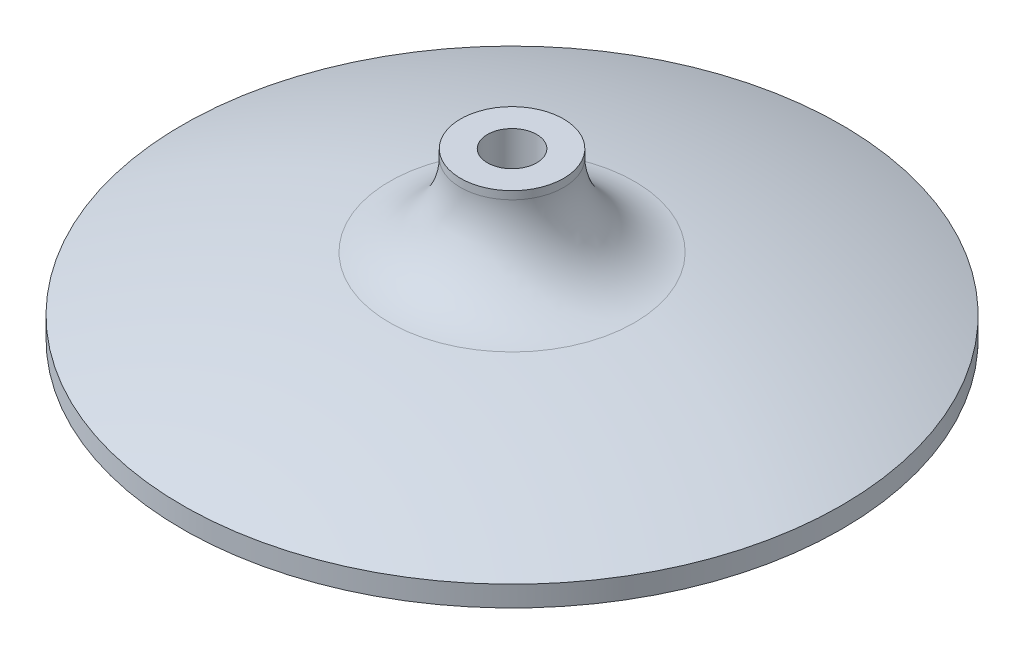
ISO-10303-21;
HEADER;
FILE_DESCRIPTION(('STEP AP214'),'2;1');
FILE_NAME('part.step','',(''),(''),'','','');
FILE_SCHEMA(('AUTOMOTIVE_DESIGN { 1 0 10303 214 1 1 1 1 }'));
ENDSEC;
DATA;
#1=APPLICATION_CONTEXT('core data for automotive mechanical design processes');
#2=APPLICATION_PROTOCOL_DEFINITION('international standard','automotive_design',2000,#1);
#3=PRODUCT_CONTEXT('',#1,'mechanical');
#4=PRODUCT('Part','Part','',(#3));
#5=PRODUCT_RELATED_PRODUCT_CATEGORY('part','',(#4));
#6=PRODUCT_DEFINITION_FORMATION('','',#4);
#7=PRODUCT_DEFINITION_CONTEXT('part definition',#1,'design');
#8=PRODUCT_DEFINITION('design','',#6,#7);
#9=PRODUCT_DEFINITION_SHAPE('','',#8);
#10=(LENGTH_UNIT() NAMED_UNIT(*) SI_UNIT(.MILLI.,.METRE.));
#11=(NAMED_UNIT(*) PLANE_ANGLE_UNIT() SI_UNIT($,.RADIAN.));
#12=(NAMED_UNIT(*) SI_UNIT($,.STERADIAN.) SOLID_ANGLE_UNIT());
#13=UNCERTAINTY_MEASURE_WITH_UNIT(LENGTH_MEASURE(1.E-05),#10,'distance_accuracy_value','');
#14=(GEOMETRIC_REPRESENTATION_CONTEXT(3) GLOBAL_UNCERTAINTY_ASSIGNED_CONTEXT((#13)) GLOBAL_UNIT_ASSIGNED_CONTEXT((#10,
#11,#12)) REPRESENTATION_CONTEXT('',''));
#15=CARTESIAN_POINT('',(0.,0.,0.));
#16=DIRECTION('',(0.,0.,1.));
#17=DIRECTION('',(1.,0.,0.));
#18=AXIS2_PLACEMENT_3D('',#15,#16,#17);
#19=CARTESIAN_POINT('',(-1.89865,0.,0.));
#20=DIRECTION('',(0.,1.,0.));
#21=DIRECTION('',(-1.,0.,0.));
#22=AXIS2_PLACEMENT_3D('',#19,#20,#21);
#23=PLANE('',#22);
#24=CARTESIAN_POINT('',(0.,0.,0.));
#25=DIRECTION('',(0.,-1.,0.));
#26=DIRECTION('',(1.,0.,0.));
#27=AXIS2_PLACEMENT_3D('',#24,#25,#26);
#28=CIRCLE('',#27,1.89865);
#29=CARTESIAN_POINT('',(1.89865,0.,0.));
#30=VERTEX_POINT('',#29);
#31=EDGE_CURVE('E383',#30,#30,#28,.T.);
#32=ORIENTED_EDGE('',*,*,#31,.F.);
#33=EDGE_LOOP('',(#32));
#34=FACE_BOUND('',#33,.T.);
#35=CARTESIAN_POINT('',(0.,0.,0.));
#36=DIRECTION('',(0.,-1.,0.));
#37=DIRECTION('',(1.,0.,0.));
#38=AXIS2_PLACEMENT_3D('',#35,#36,#37);
#39=CIRCLE('',#38,25.4);
#40=CARTESIAN_POINT('',(25.4,0.,0.));
#41=VERTEX_POINT('',#40);
#42=EDGE_CURVE('E368',#41,#41,#39,.T.);
#43=ORIENTED_EDGE('',*,*,#42,.T.);
#44=EDGE_LOOP('',(#43));
#45=FACE_BOUND('',#44,.T.);
#46=ADVANCED_FACE('F358',(#34,#45),#23,.F.);
#47=CARTESIAN_POINT('',(0.,-3.48645342387999,0.));
#48=DIRECTION('',(0.,-1.,0.));
#49=DIRECTION('',(1.,0.,0.));
#50=AXIS2_PLACEMENT_3D('',#47,#48,#49);
#51=CYLINDRICAL_SURFACE('',#50,25.4);
#52=ORIENTED_EDGE('',*,*,#42,.F.);
#53=EDGE_LOOP('',(#52));
#54=FACE_BOUND('',#53,.T.);
#55=CARTESIAN_POINT('',(0.,1.58749999999999,0.));
#56=DIRECTION('',(0.,-1.,0.));
#57=DIRECTION('',(1.,0.,0.));
#58=AXIS2_PLACEMENT_3D('',#55,#56,#57);
#59=CIRCLE('',#58,25.4);
#60=CARTESIAN_POINT('',(25.4,1.58749999999999,0.));
#61=VERTEX_POINT('',#60);
#62=EDGE_CURVE('E372',#61,#61,#59,.T.);
#63=ORIENTED_EDGE('',*,*,#62,.T.);
#64=EDGE_LOOP('',(#63));
#65=FACE_BOUND('',#64,.T.);
#66=ADVANCED_FACE('F391',(#54,#65),#51,.T.);
#67=CARTESIAN_POINT('',(0.,-63.3706650704908,0.));
#68=DIRECTION('',(0.,-1.,0.));
#69=DIRECTION('',(1.,0.,0.));
#70=AXIS2_PLACEMENT_3D('',#67,#68,#69);
#71=DEGENERATE_TOROIDAL_SURFACE('',#70,0.279939460109102,69.85,.F.);
#72=CARTESIAN_POINT('',(0.,5.80037101584883,0.));
#73=DIRECTION('',(0.,-1.,0.));
#74=DIRECTION('',(1.,0.,0.));
#75=AXIS2_PLACEMENT_3D('',#72,#73,#74);
#76=CIRCLE('',#75,9.43552587832425);
#77=CARTESIAN_POINT('',(9.43552587832425,5.80037101584883,0.));
#78=VERTEX_POINT('',#77);
#79=EDGE_CURVE('E364',#78,#78,#76,.T.);
#80=ORIENTED_EDGE('',*,*,#79,.T.);
#81=EDGE_LOOP('',(#80));
#82=FACE_BOUND('',#81,.T.);
#83=ORIENTED_EDGE('',*,*,#62,.F.);
#84=EDGE_LOOP('',(#83));
#85=FACE_BOUND('',#84,.T.);
#86=ADVANCED_FACE('F396',(#82,#85),#71,.F.);
#87=CARTESIAN_POINT('',(0.,-3.48645342387999,0.));
#88=DIRECTION('',(0.,-1.,0.));
#89=DIRECTION('',(1.,0.,0.));
#90=AXIS2_PLACEMENT_3D('',#87,#88,#89);
#91=CYLINDRICAL_SURFACE('',#90,3.96875);
#92=CARTESIAN_POINT('',(0.,12.0886470236979,0.));
#93=DIRECTION('',(0.,-1.,0.));
#94=DIRECTION('',(1.,0.,0.));
#95=AXIS2_PLACEMENT_3D('',#92,#93,#94);
#96=CIRCLE('',#95,3.96875);
#97=CARTESIAN_POINT('',(3.96875,12.0886470236979,0.));
#98=VERTEX_POINT('',#97);
#99=EDGE_CURVE('E10',#98,#98,#96,.F.);
#100=ORIENTED_EDGE('',*,*,#99,.T.);
#101=EDGE_LOOP('',(#100));
#102=FACE_BOUND('',#101,.T.);
#103=CARTESIAN_POINT('',(0.,12.7,0.));
#104=DIRECTION('',(0.,-1.,0.));
#105=DIRECTION('',(1.,0.,0.));
#106=AXIS2_PLACEMENT_3D('',#103,#104,#105);
#107=CIRCLE('',#106,3.96875);
#108=CARTESIAN_POINT('',(3.96875,12.7,0.));
#109=VERTEX_POINT('',#108);
#110=EDGE_CURVE('E377',#109,#109,#107,.T.);
#111=ORIENTED_EDGE('',*,*,#110,.T.);
#112=EDGE_LOOP('',(#111));
#113=FACE_BOUND('',#112,.T.);
#114=ADVANCED_FACE('F400',(#102,#113),#91,.T.);
#115=CARTESIAN_POINT('',(-3.96875,12.7,0.));
#116=DIRECTION('',(0.,-1.,0.));
#117=DIRECTION('',(1.,0.,0.));
#118=AXIS2_PLACEMENT_3D('',#115,#116,#117);
#119=PLANE('',#118);
#120=ORIENTED_EDGE('',*,*,#110,.F.);
#121=EDGE_LOOP('',(#120));
#122=FACE_BOUND('',#121,.T.);
#123=CARTESIAN_POINT('',(0.,12.7,0.));
#124=DIRECTION('',(0.,-1.,0.));
#125=DIRECTION('',(1.,0.,0.));
#126=AXIS2_PLACEMENT_3D('',#123,#124,#125);
#127=CIRCLE('',#126,1.89865);
#128=CARTESIAN_POINT('',(1.89865,12.7,0.));
#129=VERTEX_POINT('',#128);
#130=EDGE_CURVE('E380',#129,#129,#127,.T.);
#131=ORIENTED_EDGE('',*,*,#130,.T.);
#132=EDGE_LOOP('',(#131));
#133=FACE_BOUND('',#132,.T.);
#134=ADVANCED_FACE('F406',(#122,#133),#119,.F.);
#135=CARTESIAN_POINT('',(0.,-3.48645342387999,0.));
#136=DIRECTION('',(0.,-1.,0.));
#137=DIRECTION('',(1.,0.,0.));
#138=AXIS2_PLACEMENT_3D('',#135,#136,#137);
#139=CYLINDRICAL_SURFACE('',#138,1.89865);
#140=ORIENTED_EDGE('',*,*,#130,.F.);
#141=EDGE_LOOP('',(#140));
#142=FACE_BOUND('',#141,.T.);
#143=ORIENTED_EDGE('',*,*,#31,.T.);
#144=EDGE_LOOP('',(#143));
#145=FACE_BOUND('',#144,.T.);
#146=ADVANCED_FACE('F387',(#142,#145),#139,.F.);
#147=CARTESIAN_POINT('',(0.,12.0886470236979,0.));
#148=DIRECTION('',(0.,-1.,0.));
#149=DIRECTION('',(1.,0.,0.));
#150=AXIS2_PLACEMENT_3D('',#147,#148,#149);
#151=TOROIDAL_SURFACE('',#150,10.31875,6.35);
#152=ORIENTED_EDGE('',*,*,#99,.F.);
#153=EDGE_LOOP('',(#152));
#154=FACE_BOUND('',#153,.T.);
#155=ORIENTED_EDGE('',*,*,#79,.F.);
#156=EDGE_LOOP('',(#155));
#157=FACE_BOUND('',#156,.T.);
#158=ADVANCED_FACE('F413',(#154,#157),#151,.F.);
#159=CLOSED_SHELL('',(#46,#66,#86,#114,#134,#146,#158));
#160=MANIFOLD_SOLID_BREP('B2',#159);
#161=ADVANCED_BREP_SHAPE_REPRESENTATION('',(#18,#160),#14);
#162=SHAPE_DEFINITION_REPRESENTATION(#9,#161);
ENDSEC;
END-ISO-10303-21;
